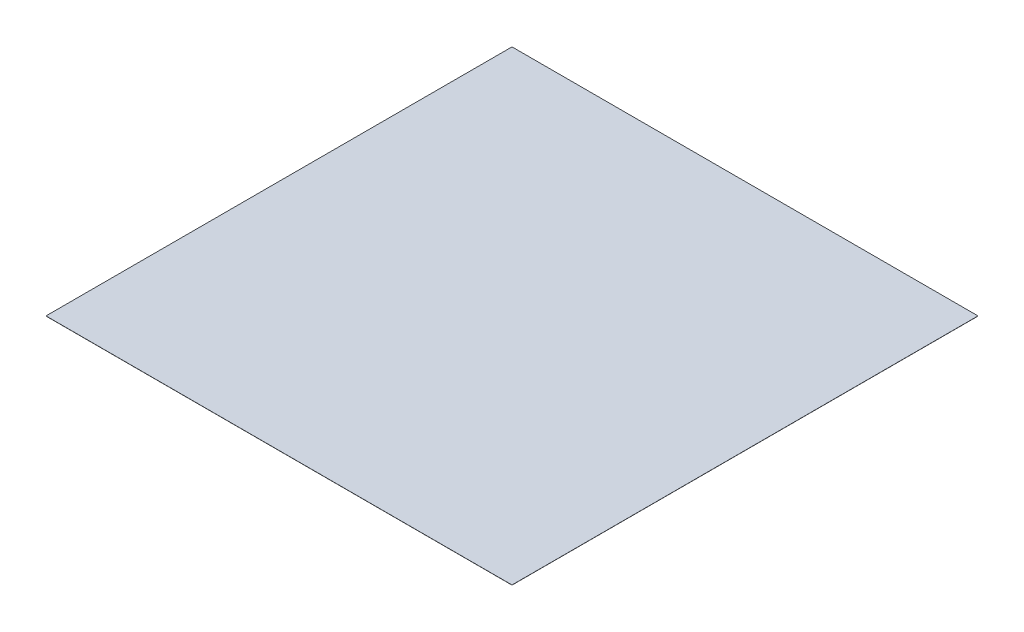
ISO-10303-21;
HEADER;
FILE_DESCRIPTION(('STEP AP214'),'2;1');
FILE_NAME('part.step','',(''),(''),'','','');
FILE_SCHEMA(('AUTOMOTIVE_DESIGN { 1 0 10303 214 1 1 1 1 }'));
ENDSEC;
DATA;
#1=APPLICATION_CONTEXT('core data for automotive mechanical design processes');
#2=APPLICATION_PROTOCOL_DEFINITION('international standard','automotive_design',2000,#1);
#3=PRODUCT_CONTEXT('',#1,'mechanical');
#4=PRODUCT('Part','Part','',(#3));
#5=PRODUCT_RELATED_PRODUCT_CATEGORY('part','',(#4));
#6=PRODUCT_DEFINITION_FORMATION('','',#4);
#7=PRODUCT_DEFINITION_CONTEXT('part definition',#1,'design');
#8=PRODUCT_DEFINITION('design','',#6,#7);
#9=PRODUCT_DEFINITION_SHAPE('','',#8);
#10=(LENGTH_UNIT() NAMED_UNIT(*) SI_UNIT(.MILLI.,.METRE.));
#11=(NAMED_UNIT(*) PLANE_ANGLE_UNIT() SI_UNIT($,.RADIAN.));
#12=(NAMED_UNIT(*) SI_UNIT($,.STERADIAN.) SOLID_ANGLE_UNIT());
#13=UNCERTAINTY_MEASURE_WITH_UNIT(LENGTH_MEASURE(1.E-05),#10,'distance_accuracy_value','');
#14=(GEOMETRIC_REPRESENTATION_CONTEXT(3) GLOBAL_UNCERTAINTY_ASSIGNED_CONTEXT((#13)) GLOBAL_UNIT_ASSIGNED_CONTEXT((#10,
#11,#12)) REPRESENTATION_CONTEXT('',''));
#15=CARTESIAN_POINT('',(0.,0.,0.));
#16=DIRECTION('',(0.,0.,1.));
#17=DIRECTION('',(1.,0.,0.));
#18=AXIS2_PLACEMENT_3D('',#15,#16,#17);
#19=CARTESIAN_POINT('',(-1423.33909904916,1.,-980.534096232376));
#20=DIRECTION('',(1.,0.,0.));
#21=DIRECTION('',(0.,0.,-1.));
#22=AXIS2_PLACEMENT_3D('',#19,#20,#21);
#23=PLANE('',#22);
#24=DIRECTION('',(0.,0.,1.));
#25=VECTOR('',#24,1.);
#26=CARTESIAN_POINT('',(-1423.33909904916,0.,-980.534096232376));
#27=LINE('',#26,#25);
#28=CARTESIAN_POINT('',(-1423.33909904916,0.,-980.534096232376));
#29=VERTEX_POINT('',#28);
#30=CARTESIAN_POINT('',(-1423.33909904916,0.,2019.46590376762));
#31=VERTEX_POINT('',#30);
#32=EDGE_CURVE('E96',#29,#31,#27,.T.);
#33=ORIENTED_EDGE('',*,*,#32,.T.);
#34=DIRECTION('',(0.,-1.,0.));
#35=VECTOR('',#34,1.);
#36=CARTESIAN_POINT('',(-1423.33909904916,1.,2019.46590376762));
#37=LINE('',#36,#35);
#38=CARTESIAN_POINT('',(-1423.33909904916,1.,2019.46590376762));
#39=VERTEX_POINT('',#38);
#40=EDGE_CURVE('E11',#39,#31,#37,.T.);
#41=ORIENTED_EDGE('',*,*,#40,.F.);
#42=DIRECTION('',(0.,0.,1.));
#43=VECTOR('',#42,1.);
#44=CARTESIAN_POINT('',(-1423.33909904916,1.,-980.534096232376));
#45=LINE('',#44,#43);
#46=CARTESIAN_POINT('',(-1423.33909904916,1.,-980.534096232376));
#47=VERTEX_POINT('',#46);
#48=EDGE_CURVE('E84',#47,#39,#45,.T.);
#49=ORIENTED_EDGE('',*,*,#48,.F.);
#50=DIRECTION('',(0.,-1.,0.));
#51=VECTOR('',#50,1.);
#52=CARTESIAN_POINT('',(-1423.33909904916,1.,-980.534096232376));
#53=LINE('',#52,#51);
#54=EDGE_CURVE('E92',#47,#29,#53,.T.);
#55=ORIENTED_EDGE('',*,*,#54,.T.);
#56=EDGE_LOOP('',(#33,#41,#49,#55));
#57=FACE_BOUND('',#56,.T.);
#58=ADVANCED_FACE('F33',(#57),#23,.F.);
#59=CARTESIAN_POINT('',(-1423.33909904916,1.,2019.46590376762));
#60=DIRECTION('',(0.,0.,-1.));
#61=DIRECTION('',(-1.,0.,0.));
#62=AXIS2_PLACEMENT_3D('',#59,#60,#61);
#63=PLANE('',#62);
#64=DIRECTION('',(1.,0.,0.));
#65=VECTOR('',#64,1.);
#66=CARTESIAN_POINT('',(-1423.33909904916,0.,2019.46590376762));
#67=LINE('',#66,#65);
#68=CARTESIAN_POINT('',(1576.66090095084,0.,2019.46590376762));
#69=VERTEX_POINT('',#68);
#70=EDGE_CURVE('E88',#31,#69,#67,.T.);
#71=ORIENTED_EDGE('',*,*,#70,.T.);
#72=DIRECTION('',(0.,-1.,0.));
#73=VECTOR('',#72,1.);
#74=CARTESIAN_POINT('',(1576.66090095084,1.,2019.46590376762));
#75=LINE('',#74,#73);
#76=CARTESIAN_POINT('',(1576.66090095084,1.,2019.46590376762));
#77=VERTEX_POINT('',#76);
#78=EDGE_CURVE('E41',#77,#69,#75,.T.);
#79=ORIENTED_EDGE('',*,*,#78,.F.);
#80=DIRECTION('',(1.,0.,0.));
#81=VECTOR('',#80,1.);
#82=CARTESIAN_POINT('',(-1423.33909904916,1.,2019.46590376762));
#83=LINE('',#82,#81);
#84=EDGE_CURVE('E79',#39,#77,#83,.T.);
#85=ORIENTED_EDGE('',*,*,#84,.F.);
#86=ORIENTED_EDGE('',*,*,#40,.T.);
#87=EDGE_LOOP('',(#71,#79,#85,#86));
#88=FACE_BOUND('',#87,.T.);
#89=ADVANCED_FACE('F87',(#88),#63,.F.);
#90=CARTESIAN_POINT('',(1576.66090095084,1.,-980.534096232376));
#91=DIRECTION('',(-1.,0.,0.));
#92=DIRECTION('',(0.,0.,1.));
#93=AXIS2_PLACEMENT_3D('',#90,#91,#92);
#94=PLANE('',#93);
#95=DIRECTION('',(0.,0.,-1.));
#96=VECTOR('',#95,1.);
#97=CARTESIAN_POINT('',(1576.66090095084,0.,-980.534096232376));
#98=LINE('',#97,#96);
#99=CARTESIAN_POINT('',(1576.66090095084,0.,-980.534096232376));
#100=VERTEX_POINT('',#99);
#101=EDGE_CURVE('E66',#69,#100,#98,.T.);
#102=ORIENTED_EDGE('',*,*,#101,.T.);
#103=DIRECTION('',(0.,-1.,0.));
#104=VECTOR('',#103,1.);
#105=CARTESIAN_POINT('',(1576.66090095084,1.,-980.534096232376));
#106=LINE('',#105,#104);
#107=CARTESIAN_POINT('',(1576.66090095084,1.,-980.534096232376));
#108=VERTEX_POINT('',#107);
#109=EDGE_CURVE('E89',#108,#100,#106,.T.);
#110=ORIENTED_EDGE('',*,*,#109,.F.);
#111=DIRECTION('',(0.,0.,-1.));
#112=VECTOR('',#111,1.);
#113=CARTESIAN_POINT('',(1576.66090095084,1.,-980.534096232376));
#114=LINE('',#113,#112);
#115=EDGE_CURVE('E82',#77,#108,#114,.T.);
#116=ORIENTED_EDGE('',*,*,#115,.F.);
#117=ORIENTED_EDGE('',*,*,#78,.T.);
#118=EDGE_LOOP('',(#102,#110,#116,#117));
#119=FACE_BOUND('',#118,.T.);
#120=ADVANCED_FACE('F90',(#119),#94,.F.);
#121=CARTESIAN_POINT('',(-1423.33909904916,1.,-980.534096232376));
#122=DIRECTION('',(0.,0.,1.));
#123=DIRECTION('',(1.,0.,0.));
#124=AXIS2_PLACEMENT_3D('',#121,#122,#123);
#125=PLANE('',#124);
#126=DIRECTION('',(-1.,0.,0.));
#127=VECTOR('',#126,1.);
#128=CARTESIAN_POINT('',(-1423.33909904916,0.,-980.534096232376));
#129=LINE('',#128,#127);
#130=EDGE_CURVE('E72',#100,#29,#129,.T.);
#131=ORIENTED_EDGE('',*,*,#130,.T.);
#132=ORIENTED_EDGE('',*,*,#54,.F.);
#133=DIRECTION('',(-1.,0.,0.));
#134=VECTOR('',#133,1.);
#135=CARTESIAN_POINT('',(-1423.33909904916,1.,-980.534096232376));
#136=LINE('',#135,#134);
#137=EDGE_CURVE('E49',#108,#47,#136,.T.);
#138=ORIENTED_EDGE('',*,*,#137,.F.);
#139=ORIENTED_EDGE('',*,*,#109,.T.);
#140=EDGE_LOOP('',(#131,#132,#138,#139));
#141=FACE_BOUND('',#140,.T.);
#142=ADVANCED_FACE('F103',(#141),#125,.F.);
#143=CARTESIAN_POINT('',(0.,1.,0.));
#144=DIRECTION('',(0.,1.,0.));
#145=DIRECTION('',(0.,0.,1.));
#146=AXIS2_PLACEMENT_3D('',#143,#144,#145);
#147=PLANE('',#146);
#148=ORIENTED_EDGE('',*,*,#48,.T.);
#149=ORIENTED_EDGE('',*,*,#84,.T.);
#150=ORIENTED_EDGE('',*,*,#115,.T.);
#151=ORIENTED_EDGE('',*,*,#137,.T.);
#152=EDGE_LOOP('',(#148,#149,#150,#151));
#153=FACE_BOUND('',#152,.T.);
#154=ADVANCED_FACE('F80',(#153),#147,.T.);
#155=CARTESIAN_POINT('',(0.,0.,0.));
#156=DIRECTION('',(0.,1.,0.));
#157=DIRECTION('',(0.,0.,1.));
#158=AXIS2_PLACEMENT_3D('',#155,#156,#157);
#159=PLANE('',#158);
#160=ORIENTED_EDGE('',*,*,#32,.F.);
#161=ORIENTED_EDGE('',*,*,#130,.F.);
#162=ORIENTED_EDGE('',*,*,#101,.F.);
#163=ORIENTED_EDGE('',*,*,#70,.F.);
#164=EDGE_LOOP('',(#160,#161,#162,#163));
#165=FACE_BOUND('',#164,.T.);
#166=ADVANCED_FACE('F106',(#165),#159,.F.);
#167=CLOSED_SHELL('',(#58,#89,#120,#142,#154,#166));
#168=MANIFOLD_SOLID_BREP('B2',#167);
#169=ADVANCED_BREP_SHAPE_REPRESENTATION('',(#18,#168),#14);
#170=SHAPE_DEFINITION_REPRESENTATION(#9,#169);
ENDSEC;
END-ISO-10303-21;
